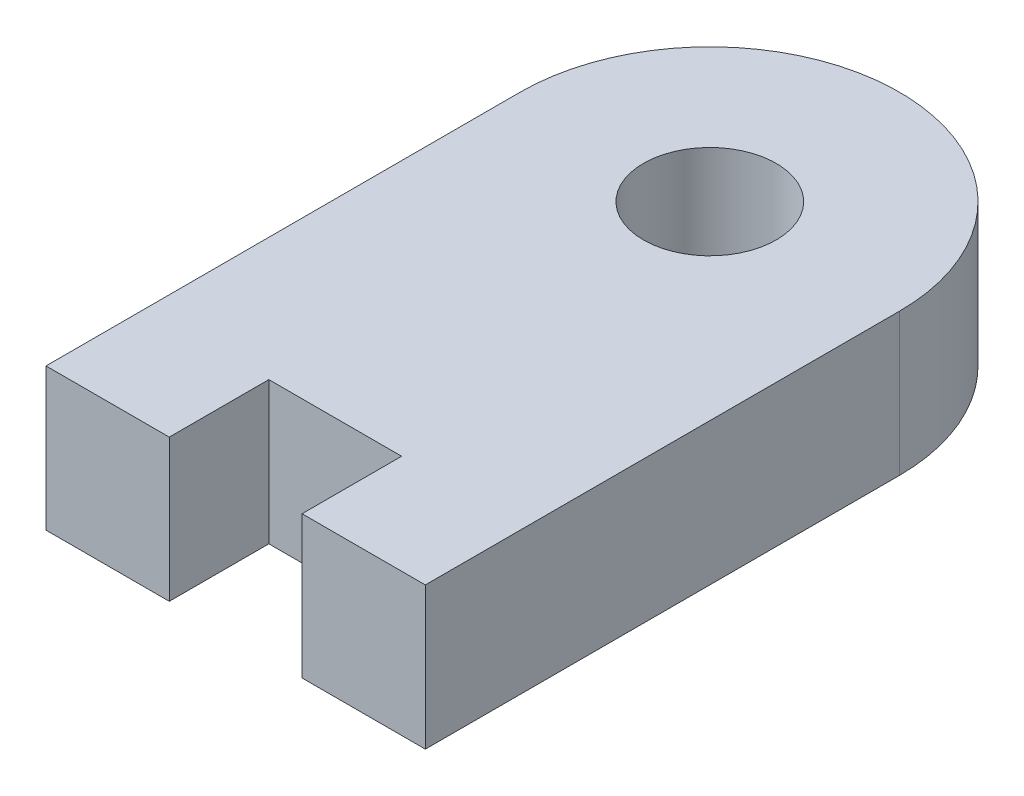
ISO-10303-21;
HEADER;
FILE_DESCRIPTION(('STEP AP214'),'2;1');
FILE_NAME('part.step','',(''),(''),'','','');
FILE_SCHEMA(('AUTOMOTIVE_DESIGN { 1 0 10303 214 1 1 1 1 }'));
ENDSEC;
DATA;
#1=APPLICATION_CONTEXT('core data for automotive mechanical design processes');
#2=APPLICATION_PROTOCOL_DEFINITION('international standard','automotive_design',2000,#1);
#3=PRODUCT_CONTEXT('',#1,'mechanical');
#4=PRODUCT('Part','Part','',(#3));
#5=PRODUCT_RELATED_PRODUCT_CATEGORY('part','',(#4));
#6=PRODUCT_DEFINITION_FORMATION('','',#4);
#7=PRODUCT_DEFINITION_CONTEXT('part definition',#1,'design');
#8=PRODUCT_DEFINITION('design','',#6,#7);
#9=PRODUCT_DEFINITION_SHAPE('','',#8);
#10=(LENGTH_UNIT() NAMED_UNIT(*) SI_UNIT(.MILLI.,.METRE.));
#11=(NAMED_UNIT(*) PLANE_ANGLE_UNIT() SI_UNIT($,.RADIAN.));
#12=(NAMED_UNIT(*) SI_UNIT($,.STERADIAN.) SOLID_ANGLE_UNIT());
#13=UNCERTAINTY_MEASURE_WITH_UNIT(LENGTH_MEASURE(1.E-05),#10,'distance_accuracy_value','');
#14=(GEOMETRIC_REPRESENTATION_CONTEXT(3) GLOBAL_UNCERTAINTY_ASSIGNED_CONTEXT((#13)) GLOBAL_UNIT_ASSIGNED_CONTEXT((#10,
#11,#12)) REPRESENTATION_CONTEXT('',''));
#15=CARTESIAN_POINT('',(0.,0.,0.));
#16=DIRECTION('',(0.,0.,1.));
#17=DIRECTION('',(1.,0.,0.));
#18=AXIS2_PLACEMENT_3D('',#15,#16,#17);
#19=CARTESIAN_POINT('',(0.,3.,0.));
#20=DIRECTION('',(0.,1.,0.));
#21=DIRECTION('',(0.,0.,1.));
#22=AXIS2_PLACEMENT_3D('',#19,#20,#21);
#23=PLANE('',#22);
#24=CARTESIAN_POINT('',(0.,3.,0.));
#25=DIRECTION('',(0.,1.,0.));
#26=DIRECTION('',(0.,0.,1.));
#27=AXIS2_PLACEMENT_3D('',#24,#25,#26);
#28=CIRCLE('',#27,4.);
#29=CARTESIAN_POINT('',(4.,3.,0.));
#30=VERTEX_POINT('',#29);
#31=CARTESIAN_POINT('',(-4.,3.,0.));
#32=VERTEX_POINT('',#31);
#33=EDGE_CURVE('E153',#30,#32,#28,.T.);
#34=ORIENTED_EDGE('',*,*,#33,.T.);
#35=DIRECTION('',(0.,0.,1.));
#36=VECTOR('',#35,1.);
#37=CARTESIAN_POINT('',(-4.,3.,0.));
#38=LINE('',#37,#36);
#39=CARTESIAN_POINT('',(-4.,3.,10.));
#40=VERTEX_POINT('',#39);
#41=EDGE_CURVE('E101',#32,#40,#38,.T.);
#42=ORIENTED_EDGE('',*,*,#41,.T.);
#43=DIRECTION('',(1.,0.,0.));
#44=VECTOR('',#43,1.);
#45=CARTESIAN_POINT('',(-1.4,3.,10.));
#46=LINE('',#45,#44);
#47=CARTESIAN_POINT('',(-1.4,3.,10.));
#48=VERTEX_POINT('',#47);
#49=EDGE_CURVE('E168',#40,#48,#46,.T.);
#50=ORIENTED_EDGE('',*,*,#49,.T.);
#51=DIRECTION('',(0.,0.,-1.));
#52=VECTOR('',#51,1.);
#53=CARTESIAN_POINT('',(-1.4,3.,10.));
#54=LINE('',#53,#52);
#55=CARTESIAN_POINT('',(-1.4,3.,7.9));
#56=VERTEX_POINT('',#55);
#57=EDGE_CURVE('E181',#48,#56,#54,.T.);
#58=ORIENTED_EDGE('',*,*,#57,.T.);
#59=DIRECTION('',(1.,0.,0.));
#60=VECTOR('',#59,1.);
#61=CARTESIAN_POINT('',(-1.4,3.,7.9));
#62=LINE('',#61,#60);
#63=CARTESIAN_POINT('',(1.4,3.,7.9));
#64=VERTEX_POINT('',#63);
#65=EDGE_CURVE('E120',#56,#64,#62,.T.);
#66=ORIENTED_EDGE('',*,*,#65,.T.);
#67=DIRECTION('',(0.,0.,1.));
#68=VECTOR('',#67,1.);
#69=CARTESIAN_POINT('',(1.4,3.,10.));
#70=LINE('',#69,#68);
#71=CARTESIAN_POINT('',(1.4,3.,10.));
#72=VERTEX_POINT('',#71);
#73=EDGE_CURVE('E114',#64,#72,#70,.T.);
#74=ORIENTED_EDGE('',*,*,#73,.T.);
#75=DIRECTION('',(1.,0.,0.));
#76=VECTOR('',#75,1.);
#77=CARTESIAN_POINT('',(4.,3.,10.));
#78=LINE('',#77,#76);
#79=CARTESIAN_POINT('',(4.,3.,10.));
#80=VERTEX_POINT('',#79);
#81=EDGE_CURVE('E118',#72,#80,#78,.T.);
#82=ORIENTED_EDGE('',*,*,#81,.T.);
#83=DIRECTION('',(0.,0.,-1.));
#84=VECTOR('',#83,1.);
#85=CARTESIAN_POINT('',(4.,3.,0.));
#86=LINE('',#85,#84);
#87=EDGE_CURVE('E58',#80,#30,#86,.T.);
#88=ORIENTED_EDGE('',*,*,#87,.T.);
#89=EDGE_LOOP('',(#34,#42,#50,#58,#66,#74,#82,#88));
#90=FACE_BOUND('',#89,.T.);
#91=CARTESIAN_POINT('',(0.,3.,0.));
#92=DIRECTION('',(0.,1.,0.));
#93=DIRECTION('',(0.,0.,1.));
#94=AXIS2_PLACEMENT_3D('',#91,#92,#93);
#95=CIRCLE('',#94,1.4);
#96=CARTESIAN_POINT('',(0.,3.,1.4));
#97=VERTEX_POINT('',#96);
#98=EDGE_CURVE('E142',#97,#97,#95,.T.);
#99=ORIENTED_EDGE('',*,*,#98,.F.);
#100=EDGE_LOOP('',(#99));
#101=FACE_BOUND('',#100,.T.);
#102=ADVANCED_FACE('F41',(#90,#101),#23,.T.);
#103=CARTESIAN_POINT('',(0.,0.,0.));
#104=DIRECTION('',(0.,1.,0.));
#105=DIRECTION('',(0.,0.,1.));
#106=AXIS2_PLACEMENT_3D('',#103,#104,#105);
#107=PLANE('',#106);
#108=CARTESIAN_POINT('',(0.,0.,0.));
#109=DIRECTION('',(0.,1.,0.));
#110=DIRECTION('',(0.,0.,1.));
#111=AXIS2_PLACEMENT_3D('',#108,#109,#110);
#112=CIRCLE('',#111,4.);
#113=CARTESIAN_POINT('',(4.,0.,0.));
#114=VERTEX_POINT('',#113);
#115=CARTESIAN_POINT('',(-4.,0.,0.));
#116=VERTEX_POINT('',#115);
#117=EDGE_CURVE('E138',#114,#116,#112,.T.);
#118=ORIENTED_EDGE('',*,*,#117,.F.);
#119=DIRECTION('',(0.,0.,-1.));
#120=VECTOR('',#119,1.);
#121=CARTESIAN_POINT('',(4.,0.,0.));
#122=LINE('',#121,#120);
#123=CARTESIAN_POINT('',(4.,0.,10.));
#124=VERTEX_POINT('',#123);
#125=EDGE_CURVE('E93',#124,#114,#122,.T.);
#126=ORIENTED_EDGE('',*,*,#125,.F.);
#127=DIRECTION('',(1.,0.,0.));
#128=VECTOR('',#127,1.);
#129=CARTESIAN_POINT('',(4.,0.,10.));
#130=LINE('',#129,#128);
#131=CARTESIAN_POINT('',(1.4,0.,10.));
#132=VERTEX_POINT('',#131);
#133=EDGE_CURVE('E87',#132,#124,#130,.T.);
#134=ORIENTED_EDGE('',*,*,#133,.F.);
#135=DIRECTION('',(0.,0.,1.));
#136=VECTOR('',#135,1.);
#137=CARTESIAN_POINT('',(1.4,0.,10.));
#138=LINE('',#137,#136);
#139=CARTESIAN_POINT('',(1.4,0.,7.9));
#140=VERTEX_POINT('',#139);
#141=EDGE_CURVE('E128',#140,#132,#138,.T.);
#142=ORIENTED_EDGE('',*,*,#141,.F.);
#143=DIRECTION('',(1.,0.,0.));
#144=VECTOR('',#143,1.);
#145=CARTESIAN_POINT('',(-1.4,0.,7.9));
#146=LINE('',#145,#144);
#147=CARTESIAN_POINT('',(-1.4,0.,7.9));
#148=VERTEX_POINT('',#147);
#149=EDGE_CURVE('E148',#148,#140,#146,.T.);
#150=ORIENTED_EDGE('',*,*,#149,.F.);
#151=DIRECTION('',(0.,0.,-1.));
#152=VECTOR('',#151,1.);
#153=CARTESIAN_POINT('',(-1.4,0.,10.));
#154=LINE('',#153,#152);
#155=CARTESIAN_POINT('',(-1.4,0.,10.));
#156=VERTEX_POINT('',#155);
#157=EDGE_CURVE('E146',#156,#148,#154,.T.);
#158=ORIENTED_EDGE('',*,*,#157,.F.);
#159=DIRECTION('',(1.,0.,0.));
#160=VECTOR('',#159,1.);
#161=CARTESIAN_POINT('',(-1.4,0.,10.));
#162=LINE('',#161,#160);
#163=CARTESIAN_POINT('',(-4.,0.,10.));
#164=VERTEX_POINT('',#163);
#165=EDGE_CURVE('E144',#164,#156,#162,.T.);
#166=ORIENTED_EDGE('',*,*,#165,.F.);
#167=DIRECTION('',(0.,0.,1.));
#168=VECTOR('',#167,1.);
#169=CARTESIAN_POINT('',(-4.,0.,0.));
#170=LINE('',#169,#168);
#171=EDGE_CURVE('E141',#116,#164,#170,.T.);
#172=ORIENTED_EDGE('',*,*,#171,.F.);
#173=EDGE_LOOP('',(#118,#126,#134,#142,#150,#158,#166,#172));
#174=FACE_BOUND('',#173,.T.);
#175=CARTESIAN_POINT('',(0.,0.,0.));
#176=DIRECTION('',(0.,1.,0.));
#177=DIRECTION('',(0.,0.,1.));
#178=AXIS2_PLACEMENT_3D('',#175,#176,#177);
#179=CIRCLE('',#178,1.4);
#180=CARTESIAN_POINT('',(0.,0.,1.4));
#181=VERTEX_POINT('',#180);
#182=EDGE_CURVE('E187',#181,#181,#179,.T.);
#183=ORIENTED_EDGE('',*,*,#182,.T.);
#184=EDGE_LOOP('',(#183));
#185=FACE_BOUND('',#184,.T.);
#186=ADVANCED_FACE('F172',(#174,#185),#107,.F.);
#187=CARTESIAN_POINT('',(0.,3.,0.));
#188=DIRECTION('',(0.,-1.,0.));
#189=DIRECTION('',(0.,0.,-1.));
#190=AXIS2_PLACEMENT_3D('',#187,#188,#189);
#191=CYLINDRICAL_SURFACE('',#190,4.);
#192=ORIENTED_EDGE('',*,*,#117,.T.);
#193=DIRECTION('',(0.,-1.,0.));
#194=VECTOR('',#193,1.);
#195=CARTESIAN_POINT('',(-4.,3.,0.));
#196=LINE('',#195,#194);
#197=EDGE_CURVE('E11',#32,#116,#196,.T.);
#198=ORIENTED_EDGE('',*,*,#197,.F.);
#199=ORIENTED_EDGE('',*,*,#33,.F.);
#200=DIRECTION('',(0.,-1.,0.));
#201=VECTOR('',#200,1.);
#202=CARTESIAN_POINT('',(4.,3.,0.));
#203=LINE('',#202,#201);
#204=EDGE_CURVE('E134',#30,#114,#203,.T.);
#205=ORIENTED_EDGE('',*,*,#204,.T.);
#206=EDGE_LOOP('',(#192,#198,#199,#205));
#207=FACE_BOUND('',#206,.T.);
#208=ADVANCED_FACE('F43',(#207),#191,.T.);
#209=CARTESIAN_POINT('',(-4.,3.,0.));
#210=DIRECTION('',(1.,0.,0.));
#211=DIRECTION('',(0.,0.,-1.));
#212=AXIS2_PLACEMENT_3D('',#209,#210,#211);
#213=PLANE('',#212);
#214=ORIENTED_EDGE('',*,*,#171,.T.);
#215=DIRECTION('',(0.,-1.,0.));
#216=VECTOR('',#215,1.);
#217=CARTESIAN_POINT('',(-4.,3.,10.));
#218=LINE('',#217,#216);
#219=EDGE_CURVE('E50',#40,#164,#218,.T.);
#220=ORIENTED_EDGE('',*,*,#219,.F.);
#221=ORIENTED_EDGE('',*,*,#41,.F.);
#222=ORIENTED_EDGE('',*,*,#197,.T.);
#223=EDGE_LOOP('',(#214,#220,#221,#222));
#224=FACE_BOUND('',#223,.T.);
#225=ADVANCED_FACE('F215',(#224),#213,.F.);
#226=CARTESIAN_POINT('',(-1.4,3.,10.));
#227=DIRECTION('',(0.,0.,-1.));
#228=DIRECTION('',(-1.,0.,0.));
#229=AXIS2_PLACEMENT_3D('',#226,#227,#228);
#230=PLANE('',#229);
#231=ORIENTED_EDGE('',*,*,#165,.T.);
#232=DIRECTION('',(0.,-1.,0.));
#233=VECTOR('',#232,1.);
#234=CARTESIAN_POINT('',(-1.4,3.,10.));
#235=LINE('',#234,#233);
#236=EDGE_CURVE('E160',#48,#156,#235,.T.);
#237=ORIENTED_EDGE('',*,*,#236,.F.);
#238=ORIENTED_EDGE('',*,*,#49,.F.);
#239=ORIENTED_EDGE('',*,*,#219,.T.);
#240=EDGE_LOOP('',(#231,#237,#238,#239));
#241=FACE_BOUND('',#240,.T.);
#242=ADVANCED_FACE('F166',(#241),#230,.F.);
#243=CARTESIAN_POINT('',(-1.4,3.,10.));
#244=DIRECTION('',(-1.,0.,0.));
#245=DIRECTION('',(0.,0.,1.));
#246=AXIS2_PLACEMENT_3D('',#243,#244,#245);
#247=PLANE('',#246);
#248=ORIENTED_EDGE('',*,*,#157,.T.);
#249=DIRECTION('',(0.,-1.,0.));
#250=VECTOR('',#249,1.);
#251=CARTESIAN_POINT('',(-1.4,3.,7.9));
#252=LINE('',#251,#250);
#253=EDGE_CURVE('E157',#56,#148,#252,.T.);
#254=ORIENTED_EDGE('',*,*,#253,.F.);
#255=ORIENTED_EDGE('',*,*,#57,.F.);
#256=ORIENTED_EDGE('',*,*,#236,.T.);
#257=EDGE_LOOP('',(#248,#254,#255,#256));
#258=FACE_BOUND('',#257,.T.);
#259=ADVANCED_FACE('F177',(#258),#247,.F.);
#260=CARTESIAN_POINT('',(-1.4,3.,7.9));
#261=DIRECTION('',(0.,0.,-1.));
#262=DIRECTION('',(-1.,0.,0.));
#263=AXIS2_PLACEMENT_3D('',#260,#261,#262);
#264=PLANE('',#263);
#265=ORIENTED_EDGE('',*,*,#149,.T.);
#266=DIRECTION('',(0.,-1.,0.));
#267=VECTOR('',#266,1.);
#268=CARTESIAN_POINT('',(1.4,3.,7.9));
#269=LINE('',#268,#267);
#270=EDGE_CURVE('E129',#64,#140,#269,.T.);
#271=ORIENTED_EDGE('',*,*,#270,.F.);
#272=ORIENTED_EDGE('',*,*,#65,.F.);
#273=ORIENTED_EDGE('',*,*,#253,.T.);
#274=EDGE_LOOP('',(#265,#271,#272,#273));
#275=FACE_BOUND('',#274,.T.);
#276=ADVANCED_FACE('F180',(#275),#264,.F.);
#277=CARTESIAN_POINT('',(1.4,3.,10.));
#278=DIRECTION('',(1.,0.,0.));
#279=DIRECTION('',(0.,0.,-1.));
#280=AXIS2_PLACEMENT_3D('',#277,#278,#279);
#281=PLANE('',#280);
#282=ORIENTED_EDGE('',*,*,#141,.T.);
#283=DIRECTION('',(0.,-1.,0.));
#284=VECTOR('',#283,1.);
#285=CARTESIAN_POINT('',(1.4,3.,10.));
#286=LINE('',#285,#284);
#287=EDGE_CURVE('E125',#72,#132,#286,.T.);
#288=ORIENTED_EDGE('',*,*,#287,.F.);
#289=ORIENTED_EDGE('',*,*,#73,.F.);
#290=ORIENTED_EDGE('',*,*,#270,.T.);
#291=EDGE_LOOP('',(#282,#288,#289,#290));
#292=FACE_BOUND('',#291,.T.);
#293=ADVANCED_FACE('F126',(#292),#281,.F.);
#294=CARTESIAN_POINT('',(4.,3.,10.));
#295=DIRECTION('',(0.,0.,-1.));
#296=DIRECTION('',(-1.,0.,0.));
#297=AXIS2_PLACEMENT_3D('',#294,#295,#296);
#298=PLANE('',#297);
#299=ORIENTED_EDGE('',*,*,#133,.T.);
#300=DIRECTION('',(0.,-1.,0.));
#301=VECTOR('',#300,1.);
#302=CARTESIAN_POINT('',(4.,3.,10.));
#303=LINE('',#302,#301);
#304=EDGE_CURVE('E130',#80,#124,#303,.T.);
#305=ORIENTED_EDGE('',*,*,#304,.F.);
#306=ORIENTED_EDGE('',*,*,#81,.F.);
#307=ORIENTED_EDGE('',*,*,#287,.T.);
#308=EDGE_LOOP('',(#299,#305,#306,#307));
#309=FACE_BOUND('',#308,.T.);
#310=ADVANCED_FACE('F132',(#309),#298,.F.);
#311=CARTESIAN_POINT('',(4.,3.,0.));
#312=DIRECTION('',(-1.,0.,0.));
#313=DIRECTION('',(0.,0.,1.));
#314=AXIS2_PLACEMENT_3D('',#311,#312,#313);
#315=PLANE('',#314);
#316=ORIENTED_EDGE('',*,*,#125,.T.);
#317=ORIENTED_EDGE('',*,*,#204,.F.);
#318=ORIENTED_EDGE('',*,*,#87,.F.);
#319=ORIENTED_EDGE('',*,*,#304,.T.);
#320=EDGE_LOOP('',(#316,#317,#318,#319));
#321=FACE_BOUND('',#320,.T.);
#322=ADVANCED_FACE('F203',(#321),#315,.F.);
#323=CARTESIAN_POINT('',(0.,3.,0.));
#324=DIRECTION('',(0.,-1.,0.));
#325=DIRECTION('',(0.,0.,-1.));
#326=AXIS2_PLACEMENT_3D('',#323,#324,#325);
#327=CYLINDRICAL_SURFACE('',#326,1.4);
#328=ORIENTED_EDGE('',*,*,#98,.T.);
#329=EDGE_LOOP('',(#328));
#330=FACE_BOUND('',#329,.T.);
#331=ORIENTED_EDGE('',*,*,#182,.F.);
#332=EDGE_LOOP('',(#331));
#333=FACE_BOUND('',#332,.T.);
#334=ADVANCED_FACE('F193',(#330,#333),#327,.F.);
#335=CLOSED_SHELL('',(#102,#186,#208,#225,#242,#259,#276,#293,#310,#322,#334));
#336=MANIFOLD_SOLID_BREP('B2',#335);
#337=ADVANCED_BREP_SHAPE_REPRESENTATION('',(#18,#336),#14);
#338=SHAPE_DEFINITION_REPRESENTATION(#9,#337);
ENDSEC;
END-ISO-10303-21;
